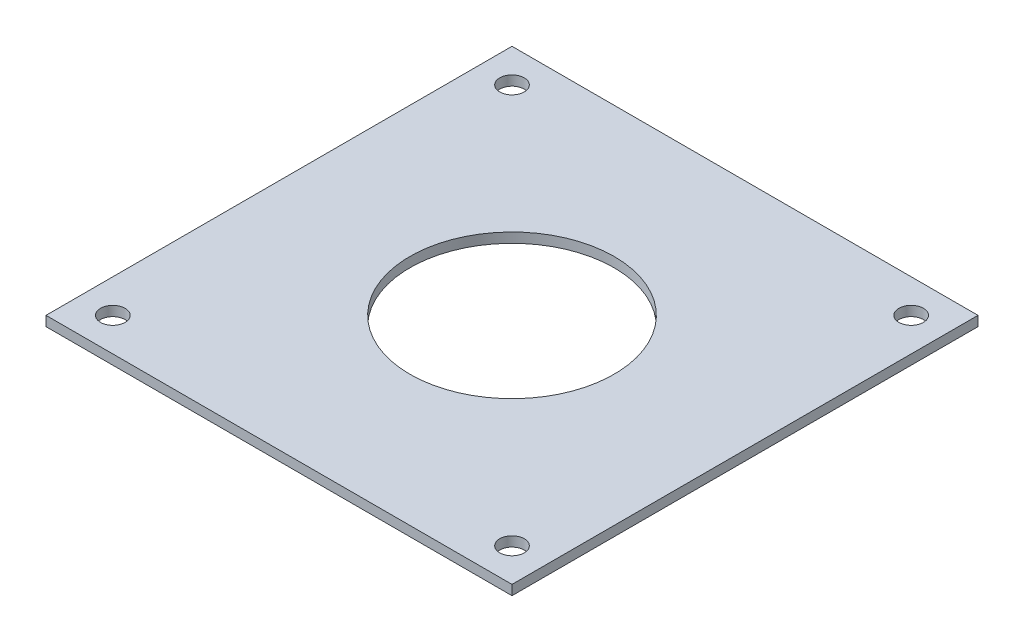
ISO-10303-21;
HEADER;
FILE_DESCRIPTION(('STEP AP214'),'2;1');
FILE_NAME('part.step','',(''),(''),'','','');
FILE_SCHEMA(('AUTOMOTIVE_DESIGN { 1 0 10303 214 1 1 1 1 }'));
ENDSEC;
DATA;
#1=APPLICATION_CONTEXT('core data for automotive mechanical design processes');
#2=APPLICATION_PROTOCOL_DEFINITION('international standard','automotive_design',2000,#1);
#3=PRODUCT_CONTEXT('',#1,'mechanical');
#4=PRODUCT('Part','Part','',(#3));
#5=PRODUCT_RELATED_PRODUCT_CATEGORY('part','',(#4));
#6=PRODUCT_DEFINITION_FORMATION('','',#4);
#7=PRODUCT_DEFINITION_CONTEXT('part definition',#1,'design');
#8=PRODUCT_DEFINITION('design','',#6,#7);
#9=PRODUCT_DEFINITION_SHAPE('','',#8);
#10=(LENGTH_UNIT() NAMED_UNIT(*) SI_UNIT(.MILLI.,.METRE.));
#11=(NAMED_UNIT(*) PLANE_ANGLE_UNIT() SI_UNIT($,.RADIAN.));
#12=(NAMED_UNIT(*) SI_UNIT($,.STERADIAN.) SOLID_ANGLE_UNIT());
#13=UNCERTAINTY_MEASURE_WITH_UNIT(LENGTH_MEASURE(1.E-05),#10,'distance_accuracy_value','');
#14=(GEOMETRIC_REPRESENTATION_CONTEXT(3) GLOBAL_UNCERTAINTY_ASSIGNED_CONTEXT((#13)) GLOBAL_UNIT_ASSIGNED_CONTEXT((#10,
#11,#12)) REPRESENTATION_CONTEXT('',''));
#15=CARTESIAN_POINT('',(0.,0.,0.));
#16=DIRECTION('',(0.,0.,1.));
#17=DIRECTION('',(1.,0.,0.));
#18=AXIS2_PLACEMENT_3D('',#15,#16,#17);
#19=CARTESIAN_POINT('',(38.,-1.6,38.));
#20=DIRECTION('',(1.,0.,0.));
#21=DIRECTION('',(0.,0.,-1.));
#22=AXIS2_PLACEMENT_3D('',#19,#20,#21);
#23=PLANE('',#22);
#24=DIRECTION('',(0.,0.,-1.));
#25=VECTOR('',#24,1.);
#26=CARTESIAN_POINT('',(38.,0.,38.));
#27=LINE('',#26,#25);
#28=CARTESIAN_POINT('',(38.,0.,38.));
#29=VERTEX_POINT('',#28);
#30=CARTESIAN_POINT('',(38.,0.,-38.));
#31=VERTEX_POINT('',#30);
#32=EDGE_CURVE('E102',#29,#31,#27,.T.);
#33=ORIENTED_EDGE('',*,*,#32,.F.);
#34=DIRECTION('',(0.,1.,0.));
#35=VECTOR('',#34,1.);
#36=CARTESIAN_POINT('',(38.,-1.6,38.));
#37=LINE('',#36,#35);
#38=CARTESIAN_POINT('',(38.,-1.6,38.));
#39=VERTEX_POINT('',#38);
#40=EDGE_CURVE('E11',#39,#29,#37,.T.);
#41=ORIENTED_EDGE('',*,*,#40,.F.);
#42=DIRECTION('',(0.,0.,-1.));
#43=VECTOR('',#42,1.);
#44=CARTESIAN_POINT('',(38.,-1.6,38.));
#45=LINE('',#44,#43);
#46=CARTESIAN_POINT('',(38.,-1.6,-38.));
#47=VERTEX_POINT('',#46);
#48=EDGE_CURVE('E95',#39,#47,#45,.T.);
#49=ORIENTED_EDGE('',*,*,#48,.T.);
#50=DIRECTION('',(0.,1.,0.));
#51=VECTOR('',#50,1.);
#52=CARTESIAN_POINT('',(38.,-1.6,-38.));
#53=LINE('',#52,#51);
#54=EDGE_CURVE('E40',#47,#31,#53,.T.);
#55=ORIENTED_EDGE('',*,*,#54,.T.);
#56=EDGE_LOOP('',(#33,#41,#49,#55));
#57=FACE_BOUND('',#56,.T.);
#58=ADVANCED_FACE('F37',(#57),#23,.T.);
#59=CARTESIAN_POINT('',(-38.,-1.6,38.));
#60=DIRECTION('',(0.,0.,1.));
#61=DIRECTION('',(1.,0.,0.));
#62=AXIS2_PLACEMENT_3D('',#59,#60,#61);
#63=PLANE('',#62);
#64=DIRECTION('',(1.,0.,0.));
#65=VECTOR('',#64,1.);
#66=CARTESIAN_POINT('',(-38.,0.,38.));
#67=LINE('',#66,#65);
#68=CARTESIAN_POINT('',(-38.,0.,38.));
#69=VERTEX_POINT('',#68);
#70=EDGE_CURVE('E97',#69,#29,#67,.T.);
#71=ORIENTED_EDGE('',*,*,#70,.F.);
#72=DIRECTION('',(0.,1.,0.));
#73=VECTOR('',#72,1.);
#74=CARTESIAN_POINT('',(-38.,-1.6,38.));
#75=LINE('',#74,#73);
#76=CARTESIAN_POINT('',(-38.,-1.6,38.));
#77=VERTEX_POINT('',#76);
#78=EDGE_CURVE('E46',#77,#69,#75,.T.);
#79=ORIENTED_EDGE('',*,*,#78,.F.);
#80=DIRECTION('',(1.,0.,0.));
#81=VECTOR('',#80,1.);
#82=CARTESIAN_POINT('',(-38.,-1.6,38.));
#83=LINE('',#82,#81);
#84=EDGE_CURVE('E92',#77,#39,#83,.T.);
#85=ORIENTED_EDGE('',*,*,#84,.T.);
#86=ORIENTED_EDGE('',*,*,#40,.T.);
#87=EDGE_LOOP('',(#71,#79,#85,#86));
#88=FACE_BOUND('',#87,.T.);
#89=ADVANCED_FACE('F113',(#88),#63,.T.);
#90=CARTESIAN_POINT('',(-38.,-1.6,38.));
#91=DIRECTION('',(-1.,0.,0.));
#92=DIRECTION('',(0.,0.,1.));
#93=AXIS2_PLACEMENT_3D('',#90,#91,#92);
#94=PLANE('',#93);
#95=DIRECTION('',(0.,0.,1.));
#96=VECTOR('',#95,1.);
#97=CARTESIAN_POINT('',(-38.,0.,38.));
#98=LINE('',#97,#96);
#99=CARTESIAN_POINT('',(-38.,0.,-38.));
#100=VERTEX_POINT('',#99);
#101=EDGE_CURVE('E87',#100,#69,#98,.T.);
#102=ORIENTED_EDGE('',*,*,#101,.F.);
#103=DIRECTION('',(0.,1.,0.));
#104=VECTOR('',#103,1.);
#105=CARTESIAN_POINT('',(-38.,-1.6,-38.));
#106=LINE('',#105,#104);
#107=CARTESIAN_POINT('',(-38.,-1.6,-38.));
#108=VERTEX_POINT('',#107);
#109=EDGE_CURVE('E82',#108,#100,#106,.T.);
#110=ORIENTED_EDGE('',*,*,#109,.F.);
#111=DIRECTION('',(0.,0.,1.));
#112=VECTOR('',#111,1.);
#113=CARTESIAN_POINT('',(-38.,-1.6,38.));
#114=LINE('',#113,#112);
#115=EDGE_CURVE('E85',#108,#77,#114,.T.);
#116=ORIENTED_EDGE('',*,*,#115,.T.);
#117=ORIENTED_EDGE('',*,*,#78,.T.);
#118=EDGE_LOOP('',(#102,#110,#116,#117));
#119=FACE_BOUND('',#118,.T.);
#120=ADVANCED_FACE('F84',(#119),#94,.T.);
#121=CARTESIAN_POINT('',(-38.,-1.6,-38.));
#122=DIRECTION('',(0.,0.,-1.));
#123=DIRECTION('',(-1.,0.,0.));
#124=AXIS2_PLACEMENT_3D('',#121,#122,#123);
#125=PLANE('',#124);
#126=DIRECTION('',(-1.,0.,0.));
#127=VECTOR('',#126,1.);
#128=CARTESIAN_POINT('',(-38.,0.,-38.));
#129=LINE('',#128,#127);
#130=EDGE_CURVE('E105',#31,#100,#129,.T.);
#131=ORIENTED_EDGE('',*,*,#130,.F.);
#132=ORIENTED_EDGE('',*,*,#54,.F.);
#133=DIRECTION('',(-1.,0.,0.));
#134=VECTOR('',#133,1.);
#135=CARTESIAN_POINT('',(-38.,-1.6,-38.));
#136=LINE('',#135,#134);
#137=EDGE_CURVE('E91',#47,#108,#136,.T.);
#138=ORIENTED_EDGE('',*,*,#137,.T.);
#139=ORIENTED_EDGE('',*,*,#109,.T.);
#140=EDGE_LOOP('',(#131,#132,#138,#139));
#141=FACE_BOUND('',#140,.T.);
#142=ADVANCED_FACE('F94',(#141),#125,.T.);
#143=CARTESIAN_POINT('',(0.,-1.6,0.));
#144=DIRECTION('',(0.,-1.,0.));
#145=DIRECTION('',(0.,0.,-1.));
#146=AXIS2_PLACEMENT_3D('',#143,#144,#145);
#147=PLANE('',#146);
#148=CARTESIAN_POINT('',(-32.55,-1.6,-32.55));
#149=DIRECTION('',(0.,1.,0.));
#150=DIRECTION('',(0.,0.,1.));
#151=AXIS2_PLACEMENT_3D('',#148,#149,#150);
#152=CIRCLE('',#151,2.);
#153=CARTESIAN_POINT('',(-32.55,-1.6,-30.55));
#154=VERTEX_POINT('',#153);
#155=EDGE_CURVE('E158',#154,#154,#152,.T.);
#156=ORIENTED_EDGE('',*,*,#155,.T.);
#157=EDGE_LOOP('',(#156));
#158=FACE_BOUND('',#157,.T.);
#159=CARTESIAN_POINT('',(-32.55,-1.6,32.55));
#160=DIRECTION('',(0.,1.,0.));
#161=DIRECTION('',(0.,0.,1.));
#162=AXIS2_PLACEMENT_3D('',#159,#160,#161);
#163=CIRCLE('',#162,2.);
#164=CARTESIAN_POINT('',(-32.55,-1.6,34.55));
#165=VERTEX_POINT('',#164);
#166=EDGE_CURVE('E166',#165,#165,#163,.T.);
#167=ORIENTED_EDGE('',*,*,#166,.T.);
#168=EDGE_LOOP('',(#167));
#169=FACE_BOUND('',#168,.T.);
#170=CARTESIAN_POINT('',(32.55,-1.6,32.55));
#171=DIRECTION('',(0.,1.,0.));
#172=DIRECTION('',(0.,0.,1.));
#173=AXIS2_PLACEMENT_3D('',#170,#171,#172);
#174=CIRCLE('',#173,2.);
#175=CARTESIAN_POINT('',(32.55,-1.6,34.55));
#176=VERTEX_POINT('',#175);
#177=EDGE_CURVE('E172',#176,#176,#174,.T.);
#178=ORIENTED_EDGE('',*,*,#177,.T.);
#179=EDGE_LOOP('',(#178));
#180=FACE_BOUND('',#179,.T.);
#181=CARTESIAN_POINT('',(0.,-1.6,0.));
#182=DIRECTION('',(0.,1.,0.));
#183=DIRECTION('',(0.,0.,1.));
#184=AXIS2_PLACEMENT_3D('',#181,#182,#183);
#185=CIRCLE('',#184,16.65);
#186=CARTESIAN_POINT('',(0.,-1.6,16.65));
#187=VERTEX_POINT('',#186);
#188=EDGE_CURVE('E178',#187,#187,#185,.T.);
#189=ORIENTED_EDGE('',*,*,#188,.T.);
#190=EDGE_LOOP('',(#189));
#191=FACE_BOUND('',#190,.T.);
#192=CARTESIAN_POINT('',(32.55,-1.6,-32.55));
#193=DIRECTION('',(0.,1.,0.));
#194=DIRECTION('',(0.,0.,1.));
#195=AXIS2_PLACEMENT_3D('',#192,#193,#194);
#196=CIRCLE('',#195,2.);
#197=CARTESIAN_POINT('',(32.55,-1.6,-30.55));
#198=VERTEX_POINT('',#197);
#199=EDGE_CURVE('E106',#198,#198,#196,.T.);
#200=ORIENTED_EDGE('',*,*,#199,.T.);
#201=EDGE_LOOP('',(#200));
#202=FACE_BOUND('',#201,.T.);
#203=ORIENTED_EDGE('',*,*,#48,.F.);
#204=ORIENTED_EDGE('',*,*,#84,.F.);
#205=ORIENTED_EDGE('',*,*,#115,.F.);
#206=ORIENTED_EDGE('',*,*,#137,.F.);
#207=EDGE_LOOP('',(#203,#204,#205,#206));
#208=FACE_BOUND('',#207,.T.);
#209=ADVANCED_FACE('F90',(#158,#169,#180,#191,#202,#208),#147,.T.);
#210=CARTESIAN_POINT('',(0.,0.,0.));
#211=DIRECTION('',(0.,-1.,0.));
#212=DIRECTION('',(0.,0.,-1.));
#213=AXIS2_PLACEMENT_3D('',#210,#211,#212);
#214=PLANE('',#213);
#215=CARTESIAN_POINT('',(-32.55,0.,-32.55));
#216=DIRECTION('',(0.,1.,0.));
#217=DIRECTION('',(0.,0.,1.));
#218=AXIS2_PLACEMENT_3D('',#215,#216,#217);
#219=CIRCLE('',#218,2.);
#220=CARTESIAN_POINT('',(-32.55,0.,-30.55));
#221=VERTEX_POINT('',#220);
#222=EDGE_CURVE('E161',#221,#221,#219,.T.);
#223=ORIENTED_EDGE('',*,*,#222,.F.);
#224=EDGE_LOOP('',(#223));
#225=FACE_BOUND('',#224,.T.);
#226=CARTESIAN_POINT('',(-32.55,0.,32.55));
#227=DIRECTION('',(0.,1.,0.));
#228=DIRECTION('',(0.,0.,1.));
#229=AXIS2_PLACEMENT_3D('',#226,#227,#228);
#230=CIRCLE('',#229,2.);
#231=CARTESIAN_POINT('',(-32.55,0.,34.55));
#232=VERTEX_POINT('',#231);
#233=EDGE_CURVE('E163',#232,#232,#230,.T.);
#234=ORIENTED_EDGE('',*,*,#233,.F.);
#235=EDGE_LOOP('',(#234));
#236=FACE_BOUND('',#235,.T.);
#237=CARTESIAN_POINT('',(32.55,0.,32.55));
#238=DIRECTION('',(0.,1.,0.));
#239=DIRECTION('',(0.,0.,1.));
#240=AXIS2_PLACEMENT_3D('',#237,#238,#239);
#241=CIRCLE('',#240,2.);
#242=CARTESIAN_POINT('',(32.55,0.,34.55));
#243=VERTEX_POINT('',#242);
#244=EDGE_CURVE('E169',#243,#243,#241,.T.);
#245=ORIENTED_EDGE('',*,*,#244,.F.);
#246=EDGE_LOOP('',(#245));
#247=FACE_BOUND('',#246,.T.);
#248=CARTESIAN_POINT('',(0.,0.,0.));
#249=DIRECTION('',(0.,1.,0.));
#250=DIRECTION('',(0.,0.,1.));
#251=AXIS2_PLACEMENT_3D('',#248,#249,#250);
#252=CIRCLE('',#251,16.65);
#253=CARTESIAN_POINT('',(0.,0.,16.65));
#254=VERTEX_POINT('',#253);
#255=EDGE_CURVE('E175',#254,#254,#252,.T.);
#256=ORIENTED_EDGE('',*,*,#255,.F.);
#257=EDGE_LOOP('',(#256));
#258=FACE_BOUND('',#257,.T.);
#259=CARTESIAN_POINT('',(32.55,0.,-32.55));
#260=DIRECTION('',(0.,1.,0.));
#261=DIRECTION('',(0.,0.,1.));
#262=AXIS2_PLACEMENT_3D('',#259,#260,#261);
#263=CIRCLE('',#262,2.);
#264=CARTESIAN_POINT('',(32.55,0.,-30.55));
#265=VERTEX_POINT('',#264);
#266=EDGE_CURVE('E181',#265,#265,#263,.T.);
#267=ORIENTED_EDGE('',*,*,#266,.F.);
#268=EDGE_LOOP('',(#267));
#269=FACE_BOUND('',#268,.T.);
#270=ORIENTED_EDGE('',*,*,#32,.T.);
#271=ORIENTED_EDGE('',*,*,#130,.T.);
#272=ORIENTED_EDGE('',*,*,#101,.T.);
#273=ORIENTED_EDGE('',*,*,#70,.T.);
#274=EDGE_LOOP('',(#270,#271,#272,#273));
#275=FACE_BOUND('',#274,.T.);
#276=ADVANCED_FACE('F112',(#225,#236,#247,#258,#269,#275),#214,.F.);
#277=CARTESIAN_POINT('',(32.55,-1.6,-32.55));
#278=DIRECTION('',(0.,1.,0.));
#279=DIRECTION('',(0.,0.,1.));
#280=AXIS2_PLACEMENT_3D('',#277,#278,#279);
#281=CYLINDRICAL_SURFACE('',#280,2.);
#282=ORIENTED_EDGE('',*,*,#199,.F.);
#283=EDGE_LOOP('',(#282));
#284=FACE_BOUND('',#283,.T.);
#285=ORIENTED_EDGE('',*,*,#266,.T.);
#286=EDGE_LOOP('',(#285));
#287=FACE_BOUND('',#286,.T.);
#288=ADVANCED_FACE('F131',(#284,#287),#281,.F.);
#289=CARTESIAN_POINT('',(0.,-1.6,0.));
#290=DIRECTION('',(0.,1.,0.));
#291=DIRECTION('',(0.,0.,1.));
#292=AXIS2_PLACEMENT_3D('',#289,#290,#291);
#293=CYLINDRICAL_SURFACE('',#292,16.65);
#294=ORIENTED_EDGE('',*,*,#188,.F.);
#295=EDGE_LOOP('',(#294));
#296=FACE_BOUND('',#295,.T.);
#297=ORIENTED_EDGE('',*,*,#255,.T.);
#298=EDGE_LOOP('',(#297));
#299=FACE_BOUND('',#298,.T.);
#300=ADVANCED_FACE('F138',(#296,#299),#293,.F.);
#301=CARTESIAN_POINT('',(32.55,-1.6,32.55));
#302=DIRECTION('',(0.,1.,0.));
#303=DIRECTION('',(0.,0.,1.));
#304=AXIS2_PLACEMENT_3D('',#301,#302,#303);
#305=CYLINDRICAL_SURFACE('',#304,2.);
#306=ORIENTED_EDGE('',*,*,#177,.F.);
#307=EDGE_LOOP('',(#306));
#308=FACE_BOUND('',#307,.T.);
#309=ORIENTED_EDGE('',*,*,#244,.T.);
#310=EDGE_LOOP('',(#309));
#311=FACE_BOUND('',#310,.T.);
#312=ADVANCED_FACE('F142',(#308,#311),#305,.F.);
#313=CARTESIAN_POINT('',(-32.55,-1.6,32.55));
#314=DIRECTION('',(0.,1.,0.));
#315=DIRECTION('',(0.,0.,1.));
#316=AXIS2_PLACEMENT_3D('',#313,#314,#315);
#317=CYLINDRICAL_SURFACE('',#316,2.);
#318=ORIENTED_EDGE('',*,*,#166,.F.);
#319=EDGE_LOOP('',(#318));
#320=FACE_BOUND('',#319,.T.);
#321=ORIENTED_EDGE('',*,*,#233,.T.);
#322=EDGE_LOOP('',(#321));
#323=FACE_BOUND('',#322,.T.);
#324=ADVANCED_FACE('F146',(#320,#323),#317,.F.);
#325=CARTESIAN_POINT('',(-32.55,-1.6,-32.55));
#326=DIRECTION('',(0.,1.,0.));
#327=DIRECTION('',(0.,0.,1.));
#328=AXIS2_PLACEMENT_3D('',#325,#326,#327);
#329=CYLINDRICAL_SURFACE('',#328,2.);
#330=ORIENTED_EDGE('',*,*,#155,.F.);
#331=EDGE_LOOP('',(#330));
#332=FACE_BOUND('',#331,.T.);
#333=ORIENTED_EDGE('',*,*,#222,.T.);
#334=EDGE_LOOP('',(#333));
#335=FACE_BOUND('',#334,.T.);
#336=ADVANCED_FACE('F150',(#332,#335),#329,.F.);
#337=CLOSED_SHELL('',(#58,#89,#120,#142,#209,#276,#288,#300,#312,#324,#336));
#338=MANIFOLD_SOLID_BREP('B2',#337);
#339=ADVANCED_BREP_SHAPE_REPRESENTATION('',(#18,#338),#14);
#340=SHAPE_DEFINITION_REPRESENTATION(#9,#339);
ENDSEC;
END-ISO-10303-21;
